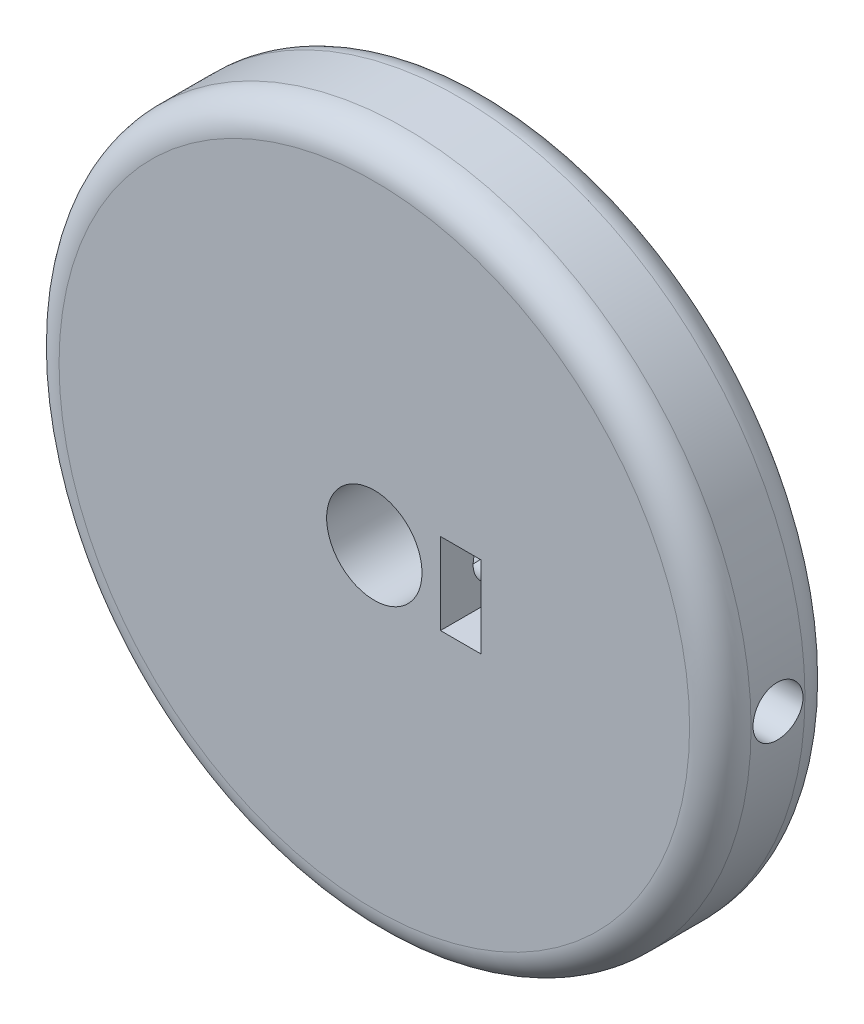
ISO-10303-21;
HEADER;
FILE_DESCRIPTION(('STEP AP214'),'2;1');
FILE_NAME('part.step','',(''),(''),'','','');
FILE_SCHEMA(('AUTOMOTIVE_DESIGN { 1 0 10303 214 1 1 1 1 }'));
ENDSEC;
DATA;
#1=APPLICATION_CONTEXT('core data for automotive mechanical design processes');
#2=APPLICATION_PROTOCOL_DEFINITION('international standard','automotive_design',2000,#1);
#3=PRODUCT_CONTEXT('',#1,'mechanical');
#4=PRODUCT('Part','Part','',(#3));
#5=PRODUCT_RELATED_PRODUCT_CATEGORY('part','',(#4));
#6=PRODUCT_DEFINITION_FORMATION('','',#4);
#7=PRODUCT_DEFINITION_CONTEXT('part definition',#1,'design');
#8=PRODUCT_DEFINITION('design','',#6,#7);
#9=PRODUCT_DEFINITION_SHAPE('','',#8);
#10=(LENGTH_UNIT() NAMED_UNIT(*) SI_UNIT(.MILLI.,.METRE.));
#11=(NAMED_UNIT(*) PLANE_ANGLE_UNIT() SI_UNIT($,.RADIAN.));
#12=(NAMED_UNIT(*) SI_UNIT($,.STERADIAN.) SOLID_ANGLE_UNIT());
#13=UNCERTAINTY_MEASURE_WITH_UNIT(LENGTH_MEASURE(1.E-05),#10,'distance_accuracy_value','');
#14=(GEOMETRIC_REPRESENTATION_CONTEXT(3) GLOBAL_UNCERTAINTY_ASSIGNED_CONTEXT((#13)) GLOBAL_UNIT_ASSIGNED_CONTEXT((#10,
#11,#12)) REPRESENTATION_CONTEXT('',''));
#15=CARTESIAN_POINT('',(0.,0.,0.));
#16=DIRECTION('',(0.,0.,1.));
#17=DIRECTION('',(1.,0.,0.));
#18=AXIS2_PLACEMENT_3D('',#15,#16,#17);
#19=CARTESIAN_POINT('',(0.,0.,7.5));
#20=DIRECTION('',(0.,0.,-1.));
#21=DIRECTION('',(-1.,0.,0.));
#22=AXIS2_PLACEMENT_3D('',#19,#20,#21);
#23=CYLINDRICAL_SURFACE('',#22,45.);
#24=CARTESIAN_POINT('',(0.,0.,-3.5));
#25=DIRECTION('',(0.,0.,1.));
#26=DIRECTION('',(1.,0.,0.));
#27=AXIS2_PLACEMENT_3D('',#24,#25,#26);
#28=CIRCLE('',#27,45.);
#29=CARTESIAN_POINT('',(45.,0.,-3.5));
#30=VERTEX_POINT('',#29);
#31=EDGE_CURVE('E126',#30,#30,#28,.T.);
#32=ORIENTED_EDGE('',*,*,#31,.T.);
#33=EDGE_LOOP('',(#32));
#34=FACE_BOUND('',#33,.T.);
#35=CARTESIAN_POINT('',(0.,0.,3.5));
#36=DIRECTION('',(0.,0.,1.));
#37=DIRECTION('',(1.,0.,0.));
#38=AXIS2_PLACEMENT_3D('',#35,#36,#37);
#39=CIRCLE('',#38,45.);
#40=CARTESIAN_POINT('',(45.,0.,3.5));
#41=VERTEX_POINT('',#40);
#42=EDGE_CURVE('E117',#41,#41,#39,.F.);
#43=ORIENTED_EDGE('',*,*,#42,.T.);
#44=EDGE_LOOP('',(#43));
#45=FACE_BOUND('',#44,.T.);
#46=CARTESIAN_POINT('',(45.,0.,-3.25));
#47=CARTESIAN_POINT('',(44.9999984494058,0.182299028308199,-3.24999200311275));
#48=CARTESIAN_POINT('',(44.9988804047486,0.364724174974901,-3.23461015787065));
#49=CARTESIAN_POINT('',(44.9945277939199,0.724532913500068,-3.17347216995663));
#50=CARTESIAN_POINT('',(44.9912907926256,0.901910459591886,-3.1276810798467));
#51=CARTESIAN_POINT('',(44.9830662901044,1.24636036899004,-3.00705057459963));
#52=CARTESIAN_POINT('',(44.9780797414118,1.41343828181252,-2.93222696376116));
#53=CARTESIAN_POINT('',(44.9669162864002,1.73262108526825,-2.75568218264258));
#54=CARTESIAN_POINT('',(44.9607396450012,1.88472929685937,-2.65396699667373));
#55=CARTESIAN_POINT('',(44.9478762970847,2.16999382121392,-2.42631060677996));
#56=CARTESIAN_POINT('',(44.9411887285938,2.30311696978586,-2.3003278916768));
#57=CARTESIAN_POINT('',(44.9280645555827,2.54634838078614,-2.02779939546756));
#58=CARTESIAN_POINT('',(44.921627961786,2.65645566068672,-1.88125273695045));
#59=CARTESIAN_POINT('',(44.9097247283925,2.85063739671801,-1.57156149122746));
#60=CARTESIAN_POINT('',(44.9042591497799,2.93468345073928,-1.40839905113406));
#61=CARTESIAN_POINT('',(44.8949257857882,3.07417542153596,-1.07023263855039));
#62=CARTESIAN_POINT('',(44.8910579784853,3.12962173074548,-0.895228828579859));
#63=CARTESIAN_POINT('',(44.8853647444468,3.21024601370135,-0.538673918025354));
#64=CARTESIAN_POINT('',(44.8835357356399,3.23547708000131,-0.357134880867127));
#65=CARTESIAN_POINT('',(44.8821156440133,3.25511861263151,0.00761012523332853));
#66=CARTESIAN_POINT('',(44.8825245286766,3.24952952678536,0.190816069916407));
#67=CARTESIAN_POINT('',(44.8855307906751,3.20773337807331,0.553331692365869));
#68=CARTESIAN_POINT('',(44.8881240539569,3.17158387216375,0.732648045016192));
#69=CARTESIAN_POINT('',(44.895200385615,3.06978237461913,1.08266112246204));
#70=CARTESIAN_POINT('',(44.8996834684028,3.00413015800022,1.25335778151385));
#71=CARTESIAN_POINT('',(44.910039001983,2.84512190855235,1.581470307108));
#72=CARTESIAN_POINT('',(44.9159127549449,2.75173988965191,1.73887353764759));
#73=CARTESIAN_POINT('',(44.9283864917976,2.53994159090433,2.03579295204009));
#74=CARTESIAN_POINT('',(44.9349864866769,2.42152493223918,2.1753088651752));
#75=CARTESIAN_POINT('',(44.9481872771533,2.1626951808063,2.43282808231021));
#76=CARTESIAN_POINT('',(44.9547880399213,2.02223229947966,2.55078135185925));
#77=CARTESIAN_POINT('',(44.967232083323,1.72347150229624,2.76144069069151));
#78=CARTESIAN_POINT('',(44.9730753636001,1.56517357804327,2.85414674808905));
#79=CARTESIAN_POINT('',(44.9833467549412,1.23520490107769,3.01167632917398));
#80=CARTESIAN_POINT('',(44.9877747627901,1.06353317415577,3.07649781937386));
#81=CARTESIAN_POINT('',(44.9947153805755,0.711704163160341,3.17638410788466));
#82=CARTESIAN_POINT('',(44.9972280203694,0.531547011406585,3.21144937004525));
#83=CARTESIAN_POINT('',(45.000050945441,0.168295078513622,3.25076551471786));
#84=CARTESIAN_POINT('',(45.0003661728444,-0.0147921816869195,3.2550855457437));
#85=CARTESIAN_POINT('',(44.998771922815,-0.379088559876984,3.23296947571151));
#86=CARTESIAN_POINT('',(44.9968624609051,-0.560297690962233,3.20653358925256));
#87=CARTESIAN_POINT('',(44.9910368738107,-0.915498135096843,3.12371338188448));
#88=CARTESIAN_POINT('',(44.9871228839414,-1.08949691617901,3.06736092714364));
#89=CARTESIAN_POINT('',(44.9777282901554,-1.42556833757355,2.92633966342568));
#90=CARTESIAN_POINT('',(44.9722476674978,-1.58764083518898,2.84167051570898));
#91=CARTESIAN_POINT('',(44.9603226762827,-1.89557485753684,2.6462442560929));
#92=CARTESIAN_POINT('',(44.9538766149728,-2.04140710834801,2.53544112200093));
#93=CARTESIAN_POINT('',(44.9407513540495,-2.31242595376507,2.29095895127025));
#94=CARTESIAN_POINT('',(44.9340721513895,-2.43761227844585,2.15727961559431));
#95=CARTESIAN_POINT('',(44.9212189333755,-2.66402121106803,1.87054062004683));
#96=CARTESIAN_POINT('',(44.9150458801005,-2.76519884459778,1.71744539936313));
#97=CARTESIAN_POINT('',(44.903916612978,-2.94041038711982,1.39639841414941));
#98=CARTESIAN_POINT('',(44.8989603896028,-3.01444450864681,1.22844676595858));
#99=CARTESIAN_POINT('',(44.8908307243212,-3.13319013183041,0.882616558190853));
#100=CARTESIAN_POINT('',(44.8876555822014,-3.17792960489519,0.704747644572323));
#101=CARTESIAN_POINT('',(44.8834414877861,-3.2369071745974,0.343998794038629));
#102=CARTESIAN_POINT('',(44.8824025057806,-3.25114569544401,0.161118926851953));
#103=CARTESIAN_POINT('',(44.8825786382035,-3.24871278203044,-0.204013503346004));
#104=CARTESIAN_POINT('',(44.8837885980184,-3.23211203195819,-0.386266544013453));
#105=CARTESIAN_POINT('',(44.8883153418377,-3.16861872779074,-0.745389649892147));
#106=CARTESIAN_POINT('',(44.8916321294284,-3.12172612213492,-0.922259705940326));
#107=CARTESIAN_POINT('',(44.8999974783367,-2.99899706906364,-1.26560400478352));
#108=CARTESIAN_POINT('',(44.9050459946121,-2.92316137445442,-1.43207851783432));
#109=CARTESIAN_POINT('',(44.9163059326703,-2.74470753817822,-1.74994316487217));
#110=CARTESIAN_POINT('',(44.9225173294708,-2.64208997185198,-1.90133362280544));
#111=CARTESIAN_POINT('',(44.9354199043219,-2.41272120058095,-2.18509319938549));
#112=CARTESIAN_POINT('',(44.9421120931734,-2.28591816511549,-2.31742037557798));
#113=CARTESIAN_POINT('',(44.9552131637994,-2.01186168302058,-2.5589602880363));
#114=CARTESIAN_POINT('',(44.9616219762003,-1.86460326484963,-2.66816738878941));
#115=CARTESIAN_POINT('',(44.973442893763,-1.5535990170943,-2.86047559810652));
#116=CARTESIAN_POINT('',(44.9788534866492,-1.38982874358666,-2.94353722925122));
#117=CARTESIAN_POINT('',(44.9880493615306,-1.05074335941571,-3.08088041389525));
#118=CARTESIAN_POINT('',(44.9918365308981,-0.87544192984616,-3.13519540522821));
#119=CARTESIAN_POINT('',(44.9963750866134,-0.58257017169186,-3.1995086592247));
#120=CARTESIAN_POINT('',(44.997728324766,-0.466888995241715,-3.21841813585429));
#121=CARTESIAN_POINT('',(44.9995412786363,-0.23415589140306,-3.24366636273512));
#122=CARTESIAN_POINT('',(45.0000009960598,-0.117103966631771,-3.25000513698414));
#123=CARTESIAN_POINT('',(45.,0.,-3.25));
#124=B_SPLINE_CURVE_WITH_KNOTS('',3,(#46,#47,#48,#49,#50,#51,#52,#53,#54,#55,#56,#57,#58,#59,
#60,#61,#62,#63,#64,#65,#66,#67,#68,#69,#70,#71,#72,#73,#74,#75,#76,#77,#78,#79,#80,#81,#82,#83,
#84,#85,#86,#87,#88,#89,#90,#91,#92,#93,#94,#95,#96,#97,#98,#99,#100,#101,#102,#103,#104,#105,
#106,#107,#108,#109,#110,#111,#112,#113,#114,#115,#116,#117,#118,#119,#120,#121,#122,#123),
.UNSPECIFIED.,.T.,.F.,(4,2,2,2,2,2,2,2,2,2,2,2,2,2,2,2,2,2,2,2,2,2,2,2,2,2,2,2,2,2,2,2,2,2,2,2,
2,2,4),(0.,0.546469561077161,1.09356823469647,1.64036950363674,2.18704919253954,
2.73467245261211,3.28231908548146,3.83056047515834,4.37879434188897,4.92606346224029,
5.47332463067169,6.01955738740401,6.56579430970755,7.1125447441234,7.65930345242425,
8.20731519930981,8.75532720418358,9.30337916616783,9.85142258478448,10.3982330187352,
10.9450396373447,11.4912649802761,12.0374968576841,12.5846979327005,13.1319061612639,
13.6801314983491,14.2283525427176,14.7760493629095,15.3237385656499,15.870174002977,
16.4166103704098,16.9630325260673,17.5094429441936,18.0570377752245,18.6047659290741,
19.1533171818579,19.7012289545589,20.0522668948348,20.4033041649703),.UNSPECIFIED.);
#125=CARTESIAN_POINT('',(45.,0.,-3.25));
#126=VERTEX_POINT('',#125);
#127=EDGE_CURVE('E104',#126,#126,#124,.T.);
#128=ORIENTED_EDGE('',*,*,#127,.F.);
#129=EDGE_LOOP('',(#128));
#130=FACE_BOUND('',#129,.T.);
#131=ADVANCED_FACE('F35',(#34,#45,#130),#23,.T.);
#132=CARTESIAN_POINT('',(0.,0.,7.5));
#133=DIRECTION('',(0.,0.,-1.));
#134=DIRECTION('',(-1.,0.,0.));
#135=AXIS2_PLACEMENT_3D('',#132,#133,#134);
#136=CYLINDRICAL_SURFACE('',#135,6.2);
#137=CARTESIAN_POINT('',(0.,0.,-7.5));
#138=DIRECTION('',(0.,0.,1.));
#139=DIRECTION('',(1.,0.,0.));
#140=AXIS2_PLACEMENT_3D('',#137,#138,#139);
#141=CIRCLE('',#140,6.2);
#142=CARTESIAN_POINT('',(6.2,0.,-7.5));
#143=VERTEX_POINT('',#142);
#144=EDGE_CURVE('E111',#143,#143,#141,.T.);
#145=ORIENTED_EDGE('',*,*,#144,.F.);
#146=EDGE_LOOP('',(#145));
#147=FACE_BOUND('',#146,.T.);
#148=CARTESIAN_POINT('',(0.,0.,7.5));
#149=DIRECTION('',(0.,0.,1.));
#150=DIRECTION('',(1.,0.,0.));
#151=AXIS2_PLACEMENT_3D('',#148,#149,#150);
#152=CIRCLE('',#151,6.2);
#153=CARTESIAN_POINT('',(6.2,0.,7.5));
#154=VERTEX_POINT('',#153);
#155=EDGE_CURVE('E114',#154,#154,#152,.T.);
#156=ORIENTED_EDGE('',*,*,#155,.T.);
#157=EDGE_LOOP('',(#156));
#158=FACE_BOUND('',#157,.T.);
#159=CARTESIAN_POINT('',(5.27991477203941,-3.25,0.));
#160=CARTESIAN_POINT('',(5.27991528784083,-3.24999949353778,-0.0840606715677976));
#161=CARTESIAN_POINT('',(5.28193125127525,-3.24673224872799,-0.168123259065365));
#162=CARTESIAN_POINT('',(5.28990418193755,-3.23372264043912,-0.335567559975331));
#163=CARTESIAN_POINT('',(5.29586273213748,-3.22397767610985,-0.418948986278766));
#164=CARTESIAN_POINT('',(5.31937446334912,-3.18515936904158,-0.66729325537681));
#165=CARTESIAN_POINT('',(5.34256327998812,-3.14650284740447,-0.830341246429851));
#166=CARTESIAN_POINT('',(5.40054399860117,-3.04588335879781,-1.14560231613235));
#167=CARTESIAN_POINT('',(5.43526918865513,-2.9840541361884,-1.29787172086837));
#168=CARTESIAN_POINT('',(5.51228890077385,-2.83925865610608,-1.58986582336248));
#169=CARTESIAN_POINT('',(5.55458443795702,-2.75628956332578,-1.72958883497939));
#170=CARTESIAN_POINT('',(5.64668385672643,-2.56270191316727,-2.00652496961582));
#171=CARTESIAN_POINT('',(5.69682071430913,-2.45025215543567,-2.14234781411611));
#172=CARTESIAN_POINT('',(5.79627001939457,-2.2047307058084,-2.39429572559847));
#173=CARTESIAN_POINT('',(5.84558200599285,-2.07164788512012,-2.5104100912595));
#174=CARTESIAN_POINT('',(5.94231697215933,-1.77615002067509,-2.72835087501502));
#175=CARTESIAN_POINT('',(5.98931238330596,-1.61227521327483,-2.82842353086855));
#176=CARTESIAN_POINT('',(6.05108385712282,-1.35362789945249,-2.95626166453442));
#177=CARTESIAN_POINT('',(6.07022607729938,-1.26523870137502,-2.99517259276675));
#178=CARTESIAN_POINT('',(6.10505478018682,-1.08476897340607,-3.06514620663532));
#179=CARTESIAN_POINT('',(6.12074327684173,-0.992690631964255,-3.0962134676513));
#180=CARTESIAN_POINT('',(6.14712006637683,-0.812740115412658,-3.1480218324448));
#181=CARTESIAN_POINT('',(6.15809902479899,-0.725084893289164,-3.16937099447244));
#182=CARTESIAN_POINT('',(6.17637821055618,-0.547971010613295,-3.20474295720809));
#183=CARTESIAN_POINT('',(6.18368029229117,-0.45851328286307,-3.21876945116997));
#184=CARTESIAN_POINT('',(6.19439568892046,-0.278531502193248,-3.23930804839206));
#185=CARTESIAN_POINT('',(6.19781032194876,-0.188007821236125,-3.24582269873508));
#186=CARTESIAN_POINT('',(6.20066092595351,-0.00669891221834673,-3.25126043802777));
#187=CARTESIAN_POINT('',(6.20009717302807,0.0840862972552598,-3.2501840537917));
#188=CARTESIAN_POINT('',(6.19291689781245,0.338342265347031,-3.23648309945775));
#189=CARTESIAN_POINT('',(6.18178121254263,0.501321754836991,-3.21523685322305));
#190=CARTESIAN_POINT('',(6.14752208305036,0.820903740247772,-3.14885929236007));
#191=CARTESIAN_POINT('',(6.1243977324657,0.977505753055596,-3.10372617184061));
#192=CARTESIAN_POINT('',(6.06789838065919,1.28256486728304,-2.99070446681712));
#193=CARTESIAN_POINT('',(6.03439811126442,1.43089475423714,-2.92253681805634));
#194=CARTESIAN_POINT('',(5.96008186602077,1.71433180423769,-2.76583288881196));
#195=CARTESIAN_POINT('',(5.91926338211003,1.8494344094769,-2.67728962233964));
#196=CARTESIAN_POINT('',(5.82918555383404,2.11719270717047,-2.47209198419147));
#197=CARTESIAN_POINT('',(5.77949004458431,2.24821879092425,-2.35350014882906));
#198=CARTESIAN_POINT('',(5.67976943592899,2.48943592995759,-2.09673893026275));
#199=CARTESIAN_POINT('',(5.62974408115347,2.59960821593475,-1.95855210452681));
#200=CARTESIAN_POINT('',(5.53085757254918,2.80419042568024,-1.65380467175078));
#201=CARTESIAN_POINT('',(5.48236295354846,2.89680655186383,-1.48589526010768));
#202=CARTESIAN_POINT('',(5.41882493470549,3.01301974467236,-1.22207899759698));
#203=CARTESIAN_POINT('',(5.39917681986622,3.04797663857055,-1.13213061747067));
#204=CARTESIAN_POINT('',(5.36373795867019,3.10991792638433,-0.948814972946551));
#205=CARTESIAN_POINT('',(5.34794472185859,3.13690747000234,-0.85544996095308));
#206=CARTESIAN_POINT('',(5.32202022286171,3.18067533138793,-0.67367011152953));
#207=CARTESIAN_POINT('',(5.31153582556026,3.19810017143436,-0.58546081406534));
#208=CARTESIAN_POINT('',(5.29487997342247,3.22560155774268,-0.407542760482199));
#209=CARTESIAN_POINT('',(5.28870616014243,3.23568212239899,-0.317834851851091));
#210=CARTESIAN_POINT('',(5.28094574819603,3.24833349548889,-0.13773234805471));
#211=CARTESIAN_POINT('',(5.27935678800114,3.2509081700019,-0.0473381304534189));
#212=CARTESIAN_POINT('',(5.28082250240462,3.24852360231521,0.133283664277894));
#213=CARTESIAN_POINT('',(5.2838767820951,3.24356500082122,0.223511254926113));
#214=CARTESIAN_POINT('',(5.29849690967798,3.21967559982481,0.470025802479281));
#215=CARTESIAN_POINT('',(5.31471296637078,3.19308052571792,0.625374149633298));
#216=CARTESIAN_POINT('',(5.35889430015366,3.11834624612638,0.928939897985213));
#217=CARTESIAN_POINT('',(5.3868639285099,3.07019906144721,1.07715463559228));
#218=CARTESIAN_POINT('',(5.45282333818239,2.95152721206581,1.37006028503787));
#219=CARTESIAN_POINT('',(5.49120826975096,2.88009093768261,1.51429050491073));
#220=CARTESIAN_POINT('',(5.5733951912077,2.71763630173486,1.7895632736009));
#221=CARTESIAN_POINT('',(5.61719995501586,2.62660789496381,1.92059900661115));
#222=CARTESIAN_POINT('',(5.71271281607794,2.41256954045403,2.18515196539438));
#223=CARTESIAN_POINT('',(5.7646635029074,2.28685866374003,2.31640701252658));
#224=CARTESIAN_POINT('',(5.86537420766424,2.01456236639875,2.55676209274438));
#225=CARTESIAN_POINT('',(5.91413278364778,1.86796760575455,2.66585215960943));
#226=CARTESIAN_POINT('',(6.00523919026515,1.55089254183209,2.86238795881561));
#227=CARTESIAN_POINT('',(6.0472827553493,1.37972874877746,2.94888256483246));
#228=CARTESIAN_POINT('',(6.11781356502269,1.02244354805821,3.09094925585295));
#229=CARTESIAN_POINT('',(6.14631381622548,0.8363366929473,3.14655101818647));
#230=CARTESIAN_POINT('',(6.18427974062056,0.473930915334021,3.22004547546281));
#231=CARTESIAN_POINT('',(6.19532441126527,0.298433265690806,3.24107439219208));
#232=CARTESIAN_POINT('',(6.20226455683185,-0.0539177819642666,3.2543249188728));
#233=CARTESIAN_POINT('',(6.19816649757016,-0.230770569160411,3.24655882404362));
#234=CARTESIAN_POINT('',(6.17618705624542,-0.56643939253264,3.20438156646134));
#235=CARTESIAN_POINT('',(6.15938820148595,-0.725597659674128,3.17206215869257));
#236=CARTESIAN_POINT('',(6.11485676871966,-1.03591033516934,3.08470134869427));
#237=CARTESIAN_POINT('',(6.08712275944921,-1.18706369285001,3.02965697202966));
#238=CARTESIAN_POINT('',(6.02181551659243,-1.48382559020931,2.89625147161881));
#239=CARTESIAN_POINT('',(5.98389799886105,-1.62898176758404,2.81705793036275));
#240=CARTESIAN_POINT('',(5.90199846722112,-1.90449601399289,2.63863036686685));
#241=CARTESIAN_POINT('',(5.85801377364142,-2.03484749764022,2.53938748044545));
#242=CARTESIAN_POINT('',(5.76263965190133,-2.29188430249098,2.31135440163607));
#243=CARTESIAN_POINT('',(5.71096261523826,-2.41666755752306,2.18053434063877));
#244=CARTESIAN_POINT('',(5.60965757744115,-2.64332834225101,1.89947076068922));
#245=CARTESIAN_POINT('',(5.56003175455099,-2.74518200791882,1.74920725963564));
#246=CARTESIAN_POINT('',(5.46632071411798,-2.92752267618957,1.42419544128699));
#247=CARTESIAN_POINT('',(5.42261003967858,-3.00676678321869,1.24862372918475));
#248=CARTESIAN_POINT('',(5.36847212281799,-3.10174433364644,0.975195424173625));
#249=CARTESIAN_POINT('',(5.35233998883373,-3.12940825688543,0.882459944925248));
#250=CARTESIAN_POINT('',(5.32455559665021,-3.17645414699211,0.694276993510416));
#251=CARTESIAN_POINT('',(5.31290032393757,-3.19584168778001,0.598831392885519));
#252=CARTESIAN_POINT('',(5.29592228300533,-3.22388493498756,0.419645444247644));
#253=CARTESIAN_POINT('',(5.28994063857242,-3.23366443118739,0.33614086729502));
#254=CARTESIAN_POINT('',(5.28193651610918,-3.24672239572612,0.168424860212436));
#255=CARTESIAN_POINT('',(5.27991425530089,-3.25000050738235,0.0842133915550935));
#256=CARTESIAN_POINT('',(5.27991477203941,-3.25,0.));
#257=B_SPLINE_CURVE_WITH_KNOTS('',3,(#159,#160,#161,#162,#163,#164,#165,#166,#167,#168,#169,
#170,#171,#172,#173,#174,#175,#176,#177,#178,#179,#180,#181,#182,#183,#184,#185,#186,#187,#188,
#189,#190,#191,#192,#193,#194,#195,#196,#197,#198,#199,#200,#201,#202,#203,#204,#205,#206,#207,
#208,#209,#210,#211,#212,#213,#214,#215,#216,#217,#218,#219,#220,#221,#222,#223,#224,#225,#226,
#227,#228,#229,#230,#231,#232,#233,#234,#235,#236,#237,#238,#239,#240,#241,#242,#243,#244,#245,
#246,#247,#248,#249,#250,#251,#252,#253,#254,#255,#256),.UNSPECIFIED.,.T.,.F.,(4,2,2,2,2,2,2,2,
2,2,2,2,2,2,2,2,2,2,2,2,2,2,2,2,2,2,2,2,2,2,2,2,2,2,2,2,2,2,2,2,2,2,2,2,2,2,2,2,4),(0.,
0.252089556328545,0.5042803895826,1.00900161318255,1.51085354190782,2.01277281514243,
2.56045347898497,3.10843057800758,3.6980059074772,3.99300672967252,4.28783507188447,
4.56011324619972,4.83225396156046,5.1043023734866,5.37633190556581,5.86798033815692,
6.35966594557479,6.85753566447542,7.35557633809756,7.90399090136768,8.45289673807387,
9.04283271518285,9.33790900948269,9.63279416130968,9.90397032349154,10.1749980009338,
10.445886054721,10.7167510707479,11.1897042972069,11.6628327691959,12.1573076568995,
12.6520366764817,13.2166221265601,13.7814608767244,14.3672165566619,14.9524085508864,
15.4808021560185,16.008970167667,16.4965823233794,16.9842583221168,17.4911278512314,
17.9982219689834,18.5598539705439,19.1220678172145,19.7109537037707,20.00488145414,
20.2986109386067,20.5511446326561,20.8036921809697),.UNSPECIFIED.);
#258=CARTESIAN_POINT('',(5.27991477203941,-3.25,0.));
#259=VERTEX_POINT('',#258);
#260=EDGE_CURVE('E149',#259,#259,#257,.T.);
#261=ORIENTED_EDGE('',*,*,#260,.T.);
#262=EDGE_LOOP('',(#261));
#263=FACE_BOUND('',#262,.T.);
#264=ADVANCED_FACE('F142',(#147,#158,#263),#136,.F.);
#265=CARTESIAN_POINT('',(0.,0.,7.5));
#266=DIRECTION('',(0.,0.,1.));
#267=DIRECTION('',(1.,0.,0.));
#268=AXIS2_PLACEMENT_3D('',#265,#266,#267);
#269=PLANE('',#268);
#270=CARTESIAN_POINT('',(0.,0.,7.5));
#271=DIRECTION('',(0.,0.,1.));
#272=DIRECTION('',(1.,0.,0.));
#273=AXIS2_PLACEMENT_3D('',#270,#271,#272);
#274=CIRCLE('',#273,41.);
#275=CARTESIAN_POINT('',(41.,0.,7.5));
#276=VERTEX_POINT('',#275);
#277=EDGE_CURVE('E11',#276,#276,#274,.T.);
#278=ORIENTED_EDGE('',*,*,#277,.T.);
#279=EDGE_LOOP('',(#278));
#280=FACE_BOUND('',#279,.T.);
#281=ORIENTED_EDGE('',*,*,#155,.F.);
#282=EDGE_LOOP('',(#281));
#283=FACE_BOUND('',#282,.T.);
#284=DIRECTION('',(1.,0.,0.));
#285=VECTOR('',#284,1.);
#286=CARTESIAN_POINT('',(0.,5.3,7.5));
#287=LINE('',#286,#285);
#288=CARTESIAN_POINT('',(8.6,5.3,7.5));
#289=VERTEX_POINT('',#288);
#290=CARTESIAN_POINT('',(13.9,5.3,7.5));
#291=VERTEX_POINT('',#290);
#292=EDGE_CURVE('E82',#289,#291,#287,.T.);
#293=ORIENTED_EDGE('',*,*,#292,.T.);
#294=DIRECTION('',(0.,-1.,0.));
#295=VECTOR('',#294,1.);
#296=CARTESIAN_POINT('',(13.9,0.,7.5));
#297=LINE('',#296,#295);
#298=CARTESIAN_POINT('',(13.9,-5.3,7.5));
#299=VERTEX_POINT('',#298);
#300=EDGE_CURVE('E50',#291,#299,#297,.T.);
#301=ORIENTED_EDGE('',*,*,#300,.T.);
#302=DIRECTION('',(1.,0.,0.));
#303=VECTOR('',#302,1.);
#304=CARTESIAN_POINT('',(0.,-5.3,7.5));
#305=LINE('',#304,#303);
#306=CARTESIAN_POINT('',(8.6,-5.3,7.5));
#307=VERTEX_POINT('',#306);
#308=EDGE_CURVE('E108',#307,#299,#305,.T.);
#309=ORIENTED_EDGE('',*,*,#308,.F.);
#310=DIRECTION('',(0.,-1.,0.));
#311=VECTOR('',#310,1.);
#312=CARTESIAN_POINT('',(8.6,0.,7.5));
#313=LINE('',#312,#311);
#314=EDGE_CURVE('E106',#289,#307,#313,.T.);
#315=ORIENTED_EDGE('',*,*,#314,.F.);
#316=EDGE_LOOP('',(#293,#301,#309,#315));
#317=FACE_BOUND('',#316,.T.);
#318=ADVANCED_FACE('F187',(#280,#283,#317),#269,.T.);
#319=CARTESIAN_POINT('',(0.,0.,-7.5));
#320=DIRECTION('',(0.,0.,1.));
#321=DIRECTION('',(1.,0.,0.));
#322=AXIS2_PLACEMENT_3D('',#319,#320,#321);
#323=PLANE('',#322);
#324=CARTESIAN_POINT('',(0.,0.,-7.5));
#325=DIRECTION('',(0.,0.,1.));
#326=DIRECTION('',(1.,0.,0.));
#327=AXIS2_PLACEMENT_3D('',#324,#325,#326);
#328=CIRCLE('',#327,41.);
#329=CARTESIAN_POINT('',(41.,0.,-7.5));
#330=VERTEX_POINT('',#329);
#331=EDGE_CURVE('E43',#330,#330,#328,.F.);
#332=ORIENTED_EDGE('',*,*,#331,.T.);
#333=EDGE_LOOP('',(#332));
#334=FACE_BOUND('',#333,.T.);
#335=ORIENTED_EDGE('',*,*,#144,.T.);
#336=EDGE_LOOP('',(#335));
#337=FACE_BOUND('',#336,.T.);
#338=ADVANCED_FACE('F131',(#334,#337),#323,.F.);
#339=CARTESIAN_POINT('',(13.9,0.,-5.5));
#340=DIRECTION('',(-1.,0.,0.));
#341=DIRECTION('',(0.,-1.,0.));
#342=AXIS2_PLACEMENT_3D('',#339,#340,#341);
#343=PLANE('',#342);
#344=CARTESIAN_POINT('',(13.9,0.,0.));
#345=DIRECTION('',(-1.,0.,0.));
#346=DIRECTION('',(0.,-1.,0.));
#347=AXIS2_PLACEMENT_3D('',#344,#345,#346);
#348=CIRCLE('',#347,3.25);
#349=CARTESIAN_POINT('',(13.9,-3.25,0.));
#350=VERTEX_POINT('',#349);
#351=EDGE_CURVE('E123',#350,#350,#348,.F.);
#352=ORIENTED_EDGE('',*,*,#351,.T.);
#353=EDGE_LOOP('',(#352));
#354=FACE_BOUND('',#353,.T.);
#355=ORIENTED_EDGE('',*,*,#300,.F.);
#356=DIRECTION('',(0.,0.,1.));
#357=VECTOR('',#356,1.);
#358=CARTESIAN_POINT('',(13.9,5.3,-5.5));
#359=LINE('',#358,#357);
#360=CARTESIAN_POINT('',(13.9,5.3,-5.5));
#361=VERTEX_POINT('',#360);
#362=EDGE_CURVE('E88',#361,#291,#359,.T.);
#363=ORIENTED_EDGE('',*,*,#362,.F.);
#364=DIRECTION('',(0.,-1.,0.));
#365=VECTOR('',#364,1.);
#366=CARTESIAN_POINT('',(13.9,0.,-5.5));
#367=LINE('',#366,#365);
#368=CARTESIAN_POINT('',(13.9,-5.3,-5.5));
#369=VERTEX_POINT('',#368);
#370=EDGE_CURVE('E56',#361,#369,#367,.T.);
#371=ORIENTED_EDGE('',*,*,#370,.T.);
#372=DIRECTION('',(0.,0.,1.));
#373=VECTOR('',#372,1.);
#374=CARTESIAN_POINT('',(13.9,-5.3,-5.5));
#375=LINE('',#374,#373);
#376=EDGE_CURVE('E70',#369,#299,#375,.T.);
#377=ORIENTED_EDGE('',*,*,#376,.T.);
#378=EDGE_LOOP('',(#355,#363,#371,#377));
#379=FACE_BOUND('',#378,.T.);
#380=ADVANCED_FACE('F175',(#354,#379),#343,.T.);
#381=CARTESIAN_POINT('',(0.,-5.3,-5.5));
#382=DIRECTION('',(0.,-1.,0.));
#383=DIRECTION('',(0.,0.,-1.));
#384=AXIS2_PLACEMENT_3D('',#381,#382,#383);
#385=PLANE('',#384);
#386=ORIENTED_EDGE('',*,*,#308,.T.);
#387=ORIENTED_EDGE('',*,*,#376,.F.);
#388=DIRECTION('',(1.,0.,0.));
#389=VECTOR('',#388,1.);
#390=CARTESIAN_POINT('',(0.,-5.3,-5.5));
#391=LINE('',#390,#389);
#392=CARTESIAN_POINT('',(8.6,-5.3,-5.5));
#393=VERTEX_POINT('',#392);
#394=EDGE_CURVE('E98',#393,#369,#391,.T.);
#395=ORIENTED_EDGE('',*,*,#394,.F.);
#396=DIRECTION('',(0.,0.,1.));
#397=VECTOR('',#396,1.);
#398=CARTESIAN_POINT('',(8.6,-5.3,-5.5));
#399=LINE('',#398,#397);
#400=EDGE_CURVE('E87',#393,#307,#399,.T.);
#401=ORIENTED_EDGE('',*,*,#400,.T.);
#402=EDGE_LOOP('',(#386,#387,#395,#401));
#403=FACE_BOUND('',#402,.T.);
#404=ADVANCED_FACE('F172',(#403),#385,.F.);
#405=CARTESIAN_POINT('',(8.6,0.,-5.5));
#406=DIRECTION('',(-1.,0.,0.));
#407=DIRECTION('',(0.,-1.,0.));
#408=AXIS2_PLACEMENT_3D('',#405,#406,#407);
#409=PLANE('',#408);
#410=CARTESIAN_POINT('',(8.6,0.,0.));
#411=DIRECTION('',(-1.,0.,0.));
#412=DIRECTION('',(0.,-1.,0.));
#413=AXIS2_PLACEMENT_3D('',#410,#411,#412);
#414=CIRCLE('',#413,3.25);
#415=CARTESIAN_POINT('',(8.6,-3.25,0.));
#416=VERTEX_POINT('',#415);
#417=EDGE_CURVE('E120',#416,#416,#414,.F.);
#418=ORIENTED_EDGE('',*,*,#417,.F.);
#419=EDGE_LOOP('',(#418));
#420=FACE_BOUND('',#419,.T.);
#421=ORIENTED_EDGE('',*,*,#314,.T.);
#422=ORIENTED_EDGE('',*,*,#400,.F.);
#423=DIRECTION('',(0.,-1.,0.));
#424=VECTOR('',#423,1.);
#425=CARTESIAN_POINT('',(8.6,0.,-5.5));
#426=LINE('',#425,#424);
#427=CARTESIAN_POINT('',(8.6,5.3,-5.5));
#428=VERTEX_POINT('',#427);
#429=EDGE_CURVE('E94',#428,#393,#426,.T.);
#430=ORIENTED_EDGE('',*,*,#429,.F.);
#431=DIRECTION('',(0.,0.,1.));
#432=VECTOR('',#431,1.);
#433=CARTESIAN_POINT('',(8.6,5.3,-5.5));
#434=LINE('',#433,#432);
#435=EDGE_CURVE('E79',#428,#289,#434,.T.);
#436=ORIENTED_EDGE('',*,*,#435,.T.);
#437=EDGE_LOOP('',(#421,#422,#430,#436));
#438=FACE_BOUND('',#437,.T.);
#439=ADVANCED_FACE('F97',(#420,#438),#409,.F.);
#440=CARTESIAN_POINT('',(0.,5.3,-5.5));
#441=DIRECTION('',(0.,-1.,0.));
#442=DIRECTION('',(1.,0.,0.));
#443=AXIS2_PLACEMENT_3D('',#440,#441,#442);
#444=PLANE('',#443);
#445=ORIENTED_EDGE('',*,*,#292,.F.);
#446=ORIENTED_EDGE('',*,*,#435,.F.);
#447=DIRECTION('',(1.,0.,0.));
#448=VECTOR('',#447,1.);
#449=CARTESIAN_POINT('',(0.,5.3,-5.5));
#450=LINE('',#449,#448);
#451=EDGE_CURVE('E77',#428,#361,#450,.T.);
#452=ORIENTED_EDGE('',*,*,#451,.T.);
#453=ORIENTED_EDGE('',*,*,#362,.T.);
#454=EDGE_LOOP('',(#445,#446,#452,#453));
#455=FACE_BOUND('',#454,.T.);
#456=ADVANCED_FACE('F80',(#455),#444,.T.);
#457=CARTESIAN_POINT('',(0.,0.,-5.5));
#458=DIRECTION('',(0.,0.,1.));
#459=DIRECTION('',(1.,0.,0.));
#460=AXIS2_PLACEMENT_3D('',#457,#458,#459);
#461=PLANE('',#460);
#462=ORIENTED_EDGE('',*,*,#370,.F.);
#463=ORIENTED_EDGE('',*,*,#451,.F.);
#464=ORIENTED_EDGE('',*,*,#429,.T.);
#465=ORIENTED_EDGE('',*,*,#394,.T.);
#466=EDGE_LOOP('',(#462,#463,#464,#465));
#467=FACE_BOUND('',#466,.T.);
#468=ADVANCED_FACE('F92',(#467),#461,.T.);
#469=CARTESIAN_POINT('',(45.,0.,0.));
#470=DIRECTION('',(-1.,0.,0.));
#471=DIRECTION('',(0.,-1.,0.));
#472=AXIS2_PLACEMENT_3D('',#469,#470,#471);
#473=CYLINDRICAL_SURFACE('',#472,3.25);
#474=ORIENTED_EDGE('',*,*,#260,.F.);
#475=EDGE_LOOP('',(#474));
#476=FACE_BOUND('',#475,.T.);
#477=ORIENTED_EDGE('',*,*,#417,.T.);
#478=EDGE_LOOP('',(#477));
#479=FACE_BOUND('',#478,.T.);
#480=ADVANCED_FACE('F167',(#476,#479),#473,.F.);
#481=ORIENTED_EDGE('',*,*,#351,.F.);
#482=EDGE_LOOP('',(#481));
#483=FACE_BOUND('',#482,.T.);
#484=ORIENTED_EDGE('',*,*,#127,.T.);
#485=EDGE_LOOP('',(#484));
#486=FACE_BOUND('',#485,.T.);
#487=ADVANCED_FACE('F137',(#483,#486),#473,.F.);
#488=CARTESIAN_POINT('',(0.,0.,-3.5));
#489=DIRECTION('',(0.,0.,1.));
#490=DIRECTION('',(1.,0.,0.));
#491=AXIS2_PLACEMENT_3D('',#488,#489,#490);
#492=TOROIDAL_SURFACE('',#491,41.,4.);
#493=ORIENTED_EDGE('',*,*,#331,.F.);
#494=EDGE_LOOP('',(#493));
#495=FACE_BOUND('',#494,.T.);
#496=ORIENTED_EDGE('',*,*,#31,.F.);
#497=EDGE_LOOP('',(#496));
#498=FACE_BOUND('',#497,.T.);
#499=ADVANCED_FACE('F134',(#495,#498),#492,.T.);
#500=CARTESIAN_POINT('',(0.,0.,3.5));
#501=DIRECTION('',(0.,0.,1.));
#502=DIRECTION('',(1.,0.,0.));
#503=AXIS2_PLACEMENT_3D('',#500,#501,#502);
#504=TOROIDAL_SURFACE('',#503,41.,4.);
#505=ORIENTED_EDGE('',*,*,#42,.F.);
#506=EDGE_LOOP('',(#505));
#507=FACE_BOUND('',#506,.T.);
#508=ORIENTED_EDGE('',*,*,#277,.F.);
#509=EDGE_LOOP('',(#508));
#510=FACE_BOUND('',#509,.T.);
#511=ADVANCED_FACE('F37',(#507,#510),#504,.T.);
#512=CLOSED_SHELL('',(#131,#264,#318,#338,#380,#404,#439,#456,#468,#480,#487,#499,#511));
#513=MANIFOLD_SOLID_BREP('B2',#512);
#514=ADVANCED_BREP_SHAPE_REPRESENTATION('',(#18,#513),#14);
#515=SHAPE_DEFINITION_REPRESENTATION(#9,#514);
ENDSEC;
END-ISO-10303-21;
